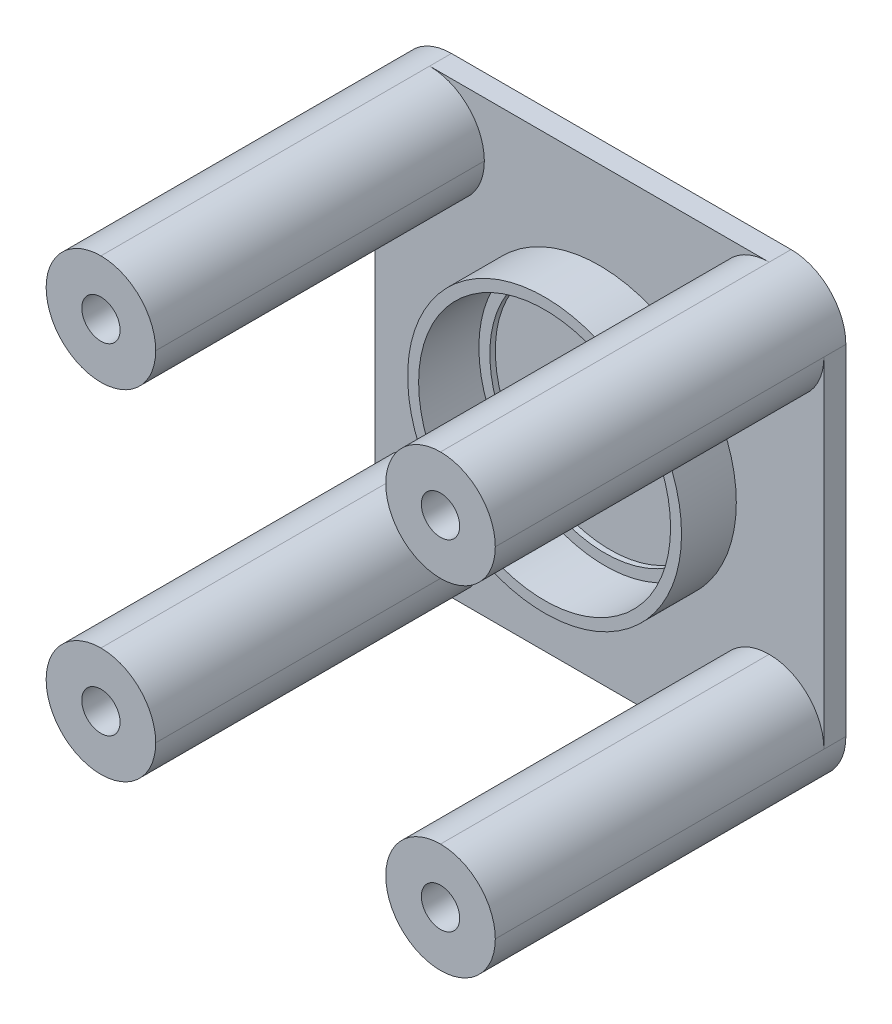
ISO-10303-21;
HEADER;
FILE_DESCRIPTION(('STEP AP214'),'2;1');
FILE_NAME('part.step','',(''),(''),'','','');
FILE_SCHEMA(('AUTOMOTIVE_DESIGN { 1 0 10303 214 1 1 1 1 }'));
ENDSEC;
DATA;
#1=APPLICATION_CONTEXT('core data for automotive mechanical design processes');
#2=APPLICATION_PROTOCOL_DEFINITION('international standard','automotive_design',2000,#1);
#3=PRODUCT_CONTEXT('',#1,'mechanical');
#4=PRODUCT('Part','Part','',(#3));
#5=PRODUCT_RELATED_PRODUCT_CATEGORY('part','',(#4));
#6=PRODUCT_DEFINITION_FORMATION('','',#4);
#7=PRODUCT_DEFINITION_CONTEXT('part definition',#1,'design');
#8=PRODUCT_DEFINITION('design','',#6,#7);
#9=PRODUCT_DEFINITION_SHAPE('','',#8);
#10=(LENGTH_UNIT() NAMED_UNIT(*) SI_UNIT(.MILLI.,.METRE.));
#11=(NAMED_UNIT(*) PLANE_ANGLE_UNIT() SI_UNIT($,.RADIAN.));
#12=(NAMED_UNIT(*) SI_UNIT($,.STERADIAN.) SOLID_ANGLE_UNIT());
#13=UNCERTAINTY_MEASURE_WITH_UNIT(LENGTH_MEASURE(1.E-05),#10,'distance_accuracy_value','');
#14=(GEOMETRIC_REPRESENTATION_CONTEXT(3) GLOBAL_UNCERTAINTY_ASSIGNED_CONTEXT((#13)) GLOBAL_UNIT_ASSIGNED_CONTEXT((#10,
#11,#12)) REPRESENTATION_CONTEXT('',''));
#15=CARTESIAN_POINT('',(0.,0.,0.));
#16=DIRECTION('',(0.,0.,1.));
#17=DIRECTION('',(1.,0.,0.));
#18=AXIS2_PLACEMENT_3D('',#15,#16,#17);
#19=CARTESIAN_POINT('',(-34.5083333333333,4.35624999999999,1.));
#20=DIRECTION('',(0.,0.,1.));
#21=DIRECTION('',(1.,0.,0.));
#22=AXIS2_PLACEMENT_3D('',#19,#20,#21);
#23=CYLINDRICAL_SURFACE('',#22,10.5);
#24=CARTESIAN_POINT('',(-34.5083333333333,4.35624999999999,1.));
#25=DIRECTION('',(0.,0.,1.));
#26=DIRECTION('',(1.,0.,0.));
#27=AXIS2_PLACEMENT_3D('',#24,#25,#26);
#28=CIRCLE('',#27,10.5);
#29=CARTESIAN_POINT('',(-24.0083333333333,4.35624999999999,1.));
#30=VERTEX_POINT('',#29);
#31=EDGE_CURVE('E317',#30,#30,#28,.T.);
#32=ORIENTED_EDGE('',*,*,#31,.F.);
#33=EDGE_LOOP('',(#32));
#34=FACE_BOUND('',#33,.T.);
#35=CARTESIAN_POINT('',(-34.5083333333333,4.35624999999999,1.5));
#36=DIRECTION('',(0.,0.,1.));
#37=DIRECTION('',(1.,0.,0.));
#38=AXIS2_PLACEMENT_3D('',#35,#36,#37);
#39=CIRCLE('',#38,10.5);
#40=CARTESIAN_POINT('',(-24.0083333333333,4.35624999999999,1.5));
#41=VERTEX_POINT('',#40);
#42=EDGE_CURVE('E45',#41,#41,#39,.F.);
#43=ORIENTED_EDGE('',*,*,#42,.F.);
#44=EDGE_LOOP('',(#43));
#45=FACE_BOUND('',#44,.T.);
#46=ADVANCED_FACE('F41',(#34,#45),#23,.F.);
#47=CARTESIAN_POINT('',(-34.5083333333333,4.35624999999999,2.));
#48=DIRECTION('',(0.,0.,-1.));
#49=DIRECTION('',(-1.,0.,0.));
#50=AXIS2_PLACEMENT_3D('',#47,#48,#49);
#51=CYLINDRICAL_SURFACE('',#50,1.25);
#52=CARTESIAN_POINT('',(-34.5083333333333,4.35624999999999,0.));
#53=DIRECTION('',(0.,0.,1.));
#54=DIRECTION('',(1.,0.,0.));
#55=AXIS2_PLACEMENT_3D('',#52,#53,#54);
#56=CIRCLE('',#55,1.25);
#57=CARTESIAN_POINT('',(-33.2583333333333,4.35624999999999,0.));
#58=VERTEX_POINT('',#57);
#59=EDGE_CURVE('E346',#58,#58,#56,.T.);
#60=ORIENTED_EDGE('',*,*,#59,.F.);
#61=EDGE_LOOP('',(#60));
#62=FACE_BOUND('',#61,.T.);
#63=CARTESIAN_POINT('',(-34.5083333333333,4.35624999999999,1.));
#64=DIRECTION('',(0.,0.,1.));
#65=DIRECTION('',(1.,0.,0.));
#66=AXIS2_PLACEMENT_3D('',#63,#64,#65);
#67=CIRCLE('',#66,1.25);
#68=CARTESIAN_POINT('',(-33.2583333333333,4.35624999999999,1.));
#69=VERTEX_POINT('',#68);
#70=EDGE_CURVE('E305',#69,#69,#67,.T.);
#71=ORIENTED_EDGE('',*,*,#70,.T.);
#72=EDGE_LOOP('',(#71));
#73=FACE_BOUND('',#72,.T.);
#74=ADVANCED_FACE('F521',(#62,#73),#51,.F.);
#75=CARTESIAN_POINT('',(0.,0.,2.));
#76=DIRECTION('',(0.,0.,1.));
#77=DIRECTION('',(1.,0.,0.));
#78=AXIS2_PLACEMENT_3D('',#75,#76,#77);
#79=PLANE('',#78);
#80=CARTESIAN_POINT('',(-34.5083333333333,4.35624999999999,2.));
#81=DIRECTION('',(0.,0.,1.));
#82=DIRECTION('',(1.,0.,0.));
#83=AXIS2_PLACEMENT_3D('',#80,#81,#82);
#84=CIRCLE('',#83,12.5);
#85=CARTESIAN_POINT('',(-22.0083333333333,4.35624999999999,2.));
#86=VERTEX_POINT('',#85);
#87=EDGE_CURVE('E832',#86,#86,#84,.T.);
#88=ORIENTED_EDGE('',*,*,#87,.F.);
#89=EDGE_LOOP('',(#88));
#90=FACE_BOUND('',#89,.T.);
#91=CARTESIAN_POINT('',(-19.0083333333333,19.85625,2.));
#92=DIRECTION('',(0.,0.,1.));
#93=DIRECTION('',(1.,0.,0.));
#94=AXIS2_PLACEMENT_3D('',#91,#92,#93);
#95=CIRCLE('',#94,5.);
#96=CARTESIAN_POINT('',(-14.0083333333333,19.85625,2.));
#97=VERTEX_POINT('',#96);
#98=CARTESIAN_POINT('',(-19.0083333333333,14.85625,2.));
#99=VERTEX_POINT('',#98);
#100=EDGE_CURVE('E59',#97,#99,#95,.F.);
#101=ORIENTED_EDGE('',*,*,#100,.T.);
#102=CARTESIAN_POINT('',(-19.0083333333333,19.85625,2.));
#103=DIRECTION('',(0.,0.,1.));
#104=DIRECTION('',(1.,0.,0.));
#105=AXIS2_PLACEMENT_3D('',#102,#103,#104);
#106=CIRCLE('',#105,5.);
#107=CARTESIAN_POINT('',(-24.0083333333333,19.85625,2.));
#108=VERTEX_POINT('',#107);
#109=EDGE_CURVE('E51',#99,#108,#106,.F.);
#110=ORIENTED_EDGE('',*,*,#109,.T.);
#111=CARTESIAN_POINT('',(-19.0083333333333,19.85625,2.));
#112=DIRECTION('',(0.,0.,1.));
#113=DIRECTION('',(1.,0.,0.));
#114=AXIS2_PLACEMENT_3D('',#111,#112,#113);
#115=CIRCLE('',#114,5.);
#116=CARTESIAN_POINT('',(-19.0083333333333,24.85625,2.));
#117=VERTEX_POINT('',#116);
#118=EDGE_CURVE('E221',#108,#117,#115,.F.);
#119=ORIENTED_EDGE('',*,*,#118,.T.);
#120=DIRECTION('',(-1.,0.,0.));
#121=VECTOR('',#120,1.);
#122=CARTESIAN_POINT('',(-55.0083333333333,24.85625,2.));
#123=LINE('',#122,#121);
#124=CARTESIAN_POINT('',(-50.0083333333333,24.85625,2.));
#125=VERTEX_POINT('',#124);
#126=EDGE_CURVE('E187',#117,#125,#123,.T.);
#127=ORIENTED_EDGE('',*,*,#126,.T.);
#128=CARTESIAN_POINT('',(-50.0083333333333,19.85625,2.));
#129=DIRECTION('',(0.,0.,1.));
#130=DIRECTION('',(1.,0.,0.));
#131=AXIS2_PLACEMENT_3D('',#128,#129,#130);
#132=CIRCLE('',#131,5.);
#133=CARTESIAN_POINT('',(-45.0083333333333,19.85625,2.));
#134=VERTEX_POINT('',#133);
#135=EDGE_CURVE('E239',#125,#134,#132,.F.);
#136=ORIENTED_EDGE('',*,*,#135,.T.);
#137=CARTESIAN_POINT('',(-50.0083333333333,19.85625,2.));
#138=DIRECTION('',(0.,0.,1.));
#139=DIRECTION('',(1.,0.,0.));
#140=AXIS2_PLACEMENT_3D('',#137,#138,#139);
#141=CIRCLE('',#140,5.);
#142=CARTESIAN_POINT('',(-50.0083333333333,14.85625,2.));
#143=VERTEX_POINT('',#142);
#144=EDGE_CURVE('E11',#134,#143,#141,.F.);
#145=ORIENTED_EDGE('',*,*,#144,.T.);
#146=CARTESIAN_POINT('',(-50.0083333333333,19.85625,2.));
#147=DIRECTION('',(0.,0.,1.));
#148=DIRECTION('',(1.,0.,0.));
#149=AXIS2_PLACEMENT_3D('',#146,#147,#148);
#150=CIRCLE('',#149,5.);
#151=CARTESIAN_POINT('',(-55.0083333333333,19.85625,2.));
#152=VERTEX_POINT('',#151);
#153=EDGE_CURVE('E235',#143,#152,#150,.F.);
#154=ORIENTED_EDGE('',*,*,#153,.T.);
#155=DIRECTION('',(0.,-1.,0.));
#156=VECTOR('',#155,1.);
#157=CARTESIAN_POINT('',(-55.0083333333333,24.85625,2.));
#158=LINE('',#157,#156);
#159=CARTESIAN_POINT('',(-55.0083333333333,-11.14375,2.));
#160=VERTEX_POINT('',#159);
#161=EDGE_CURVE('E207',#152,#160,#158,.T.);
#162=ORIENTED_EDGE('',*,*,#161,.T.);
#163=CARTESIAN_POINT('',(-50.0083333333333,-11.14375,2.));
#164=DIRECTION('',(0.,0.,1.));
#165=DIRECTION('',(1.,0.,0.));
#166=AXIS2_PLACEMENT_3D('',#163,#164,#165);
#167=CIRCLE('',#166,5.);
#168=CARTESIAN_POINT('',(-50.0083333333333,-6.14375000000001,2.));
#169=VERTEX_POINT('',#168);
#170=EDGE_CURVE('E232',#160,#169,#167,.F.);
#171=ORIENTED_EDGE('',*,*,#170,.T.);
#172=CARTESIAN_POINT('',(-50.0083333333333,-11.14375,2.));
#173=DIRECTION('',(0.,0.,1.));
#174=DIRECTION('',(1.,0.,0.));
#175=AXIS2_PLACEMENT_3D('',#172,#173,#174);
#176=CIRCLE('',#175,5.);
#177=CARTESIAN_POINT('',(-45.0083333333333,-11.14375,2.));
#178=VERTEX_POINT('',#177);
#179=EDGE_CURVE('E66',#169,#178,#176,.F.);
#180=ORIENTED_EDGE('',*,*,#179,.T.);
#181=CARTESIAN_POINT('',(-50.0083333333333,-11.14375,2.));
#182=DIRECTION('',(0.,0.,1.));
#183=DIRECTION('',(1.,0.,0.));
#184=AXIS2_PLACEMENT_3D('',#181,#182,#183);
#185=CIRCLE('',#184,5.);
#186=CARTESIAN_POINT('',(-50.0083333333333,-16.14375,2.));
#187=VERTEX_POINT('',#186);
#188=EDGE_CURVE('E244',#178,#187,#185,.F.);
#189=ORIENTED_EDGE('',*,*,#188,.T.);
#190=DIRECTION('',(1.,0.,0.));
#191=VECTOR('',#190,1.);
#192=CARTESIAN_POINT('',(-55.0083333333333,-16.14375,2.));
#193=LINE('',#192,#191);
#194=CARTESIAN_POINT('',(-19.0083333333333,-16.14375,2.));
#195=VERTEX_POINT('',#194);
#196=EDGE_CURVE('E369',#187,#195,#193,.T.);
#197=ORIENTED_EDGE('',*,*,#196,.T.);
#198=CARTESIAN_POINT('',(-19.0083333333333,-11.14375,2.));
#199=DIRECTION('',(0.,0.,1.));
#200=DIRECTION('',(1.,0.,0.));
#201=AXIS2_PLACEMENT_3D('',#198,#199,#200);
#202=CIRCLE('',#201,5.);
#203=CARTESIAN_POINT('',(-24.0083333333333,-11.14375,2.));
#204=VERTEX_POINT('',#203);
#205=EDGE_CURVE('E247',#195,#204,#202,.F.);
#206=ORIENTED_EDGE('',*,*,#205,.T.);
#207=CARTESIAN_POINT('',(-19.0083333333333,-11.14375,2.));
#208=DIRECTION('',(0.,0.,1.));
#209=DIRECTION('',(1.,0.,0.));
#210=AXIS2_PLACEMENT_3D('',#207,#208,#209);
#211=CIRCLE('',#210,5.);
#212=CARTESIAN_POINT('',(-19.0083333333333,-6.14375000000001,2.));
#213=VERTEX_POINT('',#212);
#214=EDGE_CURVE('E228',#204,#213,#211,.F.);
#215=ORIENTED_EDGE('',*,*,#214,.T.);
#216=CARTESIAN_POINT('',(-19.0083333333333,-11.14375,2.));
#217=DIRECTION('',(0.,0.,1.));
#218=DIRECTION('',(1.,0.,0.));
#219=AXIS2_PLACEMENT_3D('',#216,#217,#218);
#220=CIRCLE('',#219,5.);
#221=CARTESIAN_POINT('',(-14.0083333333333,-11.14375,2.));
#222=VERTEX_POINT('',#221);
#223=EDGE_CURVE('E250',#213,#222,#220,.F.);
#224=ORIENTED_EDGE('',*,*,#223,.T.);
#225=DIRECTION('',(0.,1.,0.));
#226=VECTOR('',#225,1.);
#227=CARTESIAN_POINT('',(-14.0083333333333,24.85625,2.));
#228=LINE('',#227,#226);
#229=EDGE_CURVE('E372',#222,#97,#228,.T.);
#230=ORIENTED_EDGE('',*,*,#229,.T.);
#231=EDGE_LOOP('',(#101,#110,#119,#127,#136,#145,#154,#162,#171,#180,#189,#197,#206,#215,#224,#230));
#232=FACE_BOUND('',#231,.T.);
#233=ADVANCED_FACE('F493',(#90,#232),#79,.T.);
#234=CARTESIAN_POINT('',(0.,0.,0.));
#235=DIRECTION('',(0.,0.,1.));
#236=DIRECTION('',(1.,0.,0.));
#237=AXIS2_PLACEMENT_3D('',#234,#235,#236);
#238=PLANE('',#237);
#239=DIRECTION('',(0.,1.,0.));
#240=VECTOR('',#239,1.);
#241=CARTESIAN_POINT('',(-14.0083333333333,24.85625,0.));
#242=LINE('',#241,#240);
#243=CARTESIAN_POINT('',(-14.0083333333333,-11.14375,0.));
#244=VERTEX_POINT('',#243);
#245=CARTESIAN_POINT('',(-14.0083333333333,19.85625,0.));
#246=VERTEX_POINT('',#245);
#247=EDGE_CURVE('E208',#244,#246,#242,.T.);
#248=ORIENTED_EDGE('',*,*,#247,.F.);
#249=CARTESIAN_POINT('',(-19.0083333333333,-11.14375,0.));
#250=DIRECTION('',(0.,0.,1.));
#251=DIRECTION('',(1.,0.,0.));
#252=AXIS2_PLACEMENT_3D('',#249,#250,#251);
#253=CIRCLE('',#252,5.);
#254=CARTESIAN_POINT('',(-19.0083333333333,-16.14375,0.));
#255=VERTEX_POINT('',#254);
#256=EDGE_CURVE('E216',#244,#255,#253,.F.);
#257=ORIENTED_EDGE('',*,*,#256,.T.);
#258=DIRECTION('',(1.,0.,0.));
#259=VECTOR('',#258,1.);
#260=CARTESIAN_POINT('',(-55.0083333333333,-16.14375,0.));
#261=LINE('',#260,#259);
#262=CARTESIAN_POINT('',(-50.0083333333333,-16.14375,0.));
#263=VERTEX_POINT('',#262);
#264=EDGE_CURVE('E380',#263,#255,#261,.T.);
#265=ORIENTED_EDGE('',*,*,#264,.F.);
#266=CARTESIAN_POINT('',(-50.0083333333333,-11.14375,0.));
#267=DIRECTION('',(0.,0.,1.));
#268=DIRECTION('',(1.,0.,0.));
#269=AXIS2_PLACEMENT_3D('',#266,#267,#268);
#270=CIRCLE('',#269,5.);
#271=CARTESIAN_POINT('',(-55.0083333333333,-11.14375,0.));
#272=VERTEX_POINT('',#271);
#273=EDGE_CURVE('E217',#263,#272,#270,.F.);
#274=ORIENTED_EDGE('',*,*,#273,.T.);
#275=DIRECTION('',(0.,-1.,0.));
#276=VECTOR('',#275,1.);
#277=CARTESIAN_POINT('',(-55.0083333333333,24.85625,0.));
#278=LINE('',#277,#276);
#279=CARTESIAN_POINT('',(-55.0083333333333,19.85625,0.));
#280=VERTEX_POINT('',#279);
#281=EDGE_CURVE('E366',#280,#272,#278,.T.);
#282=ORIENTED_EDGE('',*,*,#281,.F.);
#283=CARTESIAN_POINT('',(-50.0083333333333,19.85625,0.));
#284=DIRECTION('',(0.,0.,1.));
#285=DIRECTION('',(1.,0.,0.));
#286=AXIS2_PLACEMENT_3D('',#283,#284,#285);
#287=CIRCLE('',#286,5.);
#288=CARTESIAN_POINT('',(-50.0083333333333,24.85625,0.));
#289=VERTEX_POINT('',#288);
#290=EDGE_CURVE('E205',#280,#289,#287,.F.);
#291=ORIENTED_EDGE('',*,*,#290,.T.);
#292=DIRECTION('',(-1.,0.,0.));
#293=VECTOR('',#292,1.);
#294=CARTESIAN_POINT('',(-55.0083333333333,24.85625,0.));
#295=LINE('',#294,#293);
#296=CARTESIAN_POINT('',(-19.0083333333333,24.85625,0.));
#297=VERTEX_POINT('',#296);
#298=EDGE_CURVE('E185',#297,#289,#295,.T.);
#299=ORIENTED_EDGE('',*,*,#298,.F.);
#300=CARTESIAN_POINT('',(-19.0083333333333,19.85625,0.));
#301=DIRECTION('',(0.,0.,1.));
#302=DIRECTION('',(1.,0.,0.));
#303=AXIS2_PLACEMENT_3D('',#300,#301,#302);
#304=CIRCLE('',#303,5.);
#305=EDGE_CURVE('E201',#297,#246,#304,.F.);
#306=ORIENTED_EDGE('',*,*,#305,.T.);
#307=EDGE_LOOP('',(#248,#257,#265,#274,#282,#291,#299,#306));
#308=FACE_BOUND('',#307,.T.);
#309=CARTESIAN_POINT('',(-50.0083333333333,19.85625,0.));
#310=DIRECTION('',(0.,0.,1.));
#311=DIRECTION('',(1.,0.,0.));
#312=AXIS2_PLACEMENT_3D('',#309,#310,#311);
#313=CIRCLE('',#312,1.75);
#314=CARTESIAN_POINT('',(-48.2583333333333,19.85625,0.));
#315=VERTEX_POINT('',#314);
#316=EDGE_CURVE('E362',#315,#315,#313,.T.);
#317=ORIENTED_EDGE('',*,*,#316,.T.);
#318=EDGE_LOOP('',(#317));
#319=FACE_BOUND('',#318,.T.);
#320=CARTESIAN_POINT('',(-50.0083333333333,-11.14375,0.));
#321=DIRECTION('',(0.,0.,1.));
#322=DIRECTION('',(1.,0.,0.));
#323=AXIS2_PLACEMENT_3D('',#320,#321,#322);
#324=CIRCLE('',#323,1.75);
#325=CARTESIAN_POINT('',(-48.2583333333333,-11.14375,0.));
#326=VERTEX_POINT('',#325);
#327=EDGE_CURVE('E358',#326,#326,#324,.T.);
#328=ORIENTED_EDGE('',*,*,#327,.T.);
#329=EDGE_LOOP('',(#328));
#330=FACE_BOUND('',#329,.T.);
#331=CARTESIAN_POINT('',(-19.0083333333333,-11.14375,0.));
#332=DIRECTION('',(0.,0.,1.));
#333=DIRECTION('',(1.,0.,0.));
#334=AXIS2_PLACEMENT_3D('',#331,#332,#333);
#335=CIRCLE('',#334,1.75);
#336=CARTESIAN_POINT('',(-17.2583333333333,-11.14375,0.));
#337=VERTEX_POINT('',#336);
#338=EDGE_CURVE('E354',#337,#337,#335,.T.);
#339=ORIENTED_EDGE('',*,*,#338,.T.);
#340=EDGE_LOOP('',(#339));
#341=FACE_BOUND('',#340,.T.);
#342=CARTESIAN_POINT('',(-19.0083333333333,19.85625,0.));
#343=DIRECTION('',(0.,0.,1.));
#344=DIRECTION('',(1.,0.,0.));
#345=AXIS2_PLACEMENT_3D('',#342,#343,#344);
#346=CIRCLE('',#345,1.75);
#347=CARTESIAN_POINT('',(-17.2583333333333,19.85625,0.));
#348=VERTEX_POINT('',#347);
#349=EDGE_CURVE('E350',#348,#348,#346,.T.);
#350=ORIENTED_EDGE('',*,*,#349,.T.);
#351=EDGE_LOOP('',(#350));
#352=FACE_BOUND('',#351,.T.);
#353=ORIENTED_EDGE('',*,*,#59,.T.);
#354=EDGE_LOOP('',(#353));
#355=FACE_BOUND('',#354,.T.);
#356=ADVANCED_FACE('F199',(#308,#319,#330,#341,#352,#355),#238,.F.);
#357=CARTESIAN_POINT('',(-55.0083333333333,24.85625,2.));
#358=DIRECTION('',(1.,0.,0.));
#359=DIRECTION('',(0.,1.,0.));
#360=AXIS2_PLACEMENT_3D('',#357,#358,#359);
#361=PLANE('',#360);
#362=DIRECTION('',(0.,0.,-1.));
#363=VECTOR('',#362,1.);
#364=CARTESIAN_POINT('',(-55.0083333333333,-11.14375,2.));
#365=LINE('',#364,#363);
#366=EDGE_CURVE('E416',#272,#160,#365,.F.);
#367=ORIENTED_EDGE('',*,*,#366,.T.);
#368=ORIENTED_EDGE('',*,*,#161,.F.);
#369=DIRECTION('',(0.,0.,-1.));
#370=VECTOR('',#369,1.);
#371=CARTESIAN_POINT('',(-55.0083333333333,19.85625,2.));
#372=LINE('',#371,#370);
#373=EDGE_CURVE('E413',#152,#280,#372,.T.);
#374=ORIENTED_EDGE('',*,*,#373,.T.);
#375=ORIENTED_EDGE('',*,*,#281,.T.);
#376=EDGE_LOOP('',(#367,#368,#374,#375));
#377=FACE_BOUND('',#376,.T.);
#378=ADVANCED_FACE('F481',(#377),#361,.F.);
#379=CARTESIAN_POINT('',(-55.0083333333333,-16.14375,2.));
#380=DIRECTION('',(0.,1.,0.));
#381=DIRECTION('',(0.,0.,1.));
#382=AXIS2_PLACEMENT_3D('',#379,#380,#381);
#383=PLANE('',#382);
#384=DIRECTION('',(0.,0.,-1.));
#385=VECTOR('',#384,1.);
#386=CARTESIAN_POINT('',(-19.0083333333333,-16.14375,2.));
#387=LINE('',#386,#385);
#388=EDGE_CURVE('E449',#255,#195,#387,.F.);
#389=ORIENTED_EDGE('',*,*,#388,.T.);
#390=ORIENTED_EDGE('',*,*,#196,.F.);
#391=DIRECTION('',(0.,0.,-1.));
#392=VECTOR('',#391,1.);
#393=CARTESIAN_POINT('',(-50.0083333333333,-16.14375,2.));
#394=LINE('',#393,#392);
#395=EDGE_CURVE('E446',#187,#263,#394,.T.);
#396=ORIENTED_EDGE('',*,*,#395,.T.);
#397=ORIENTED_EDGE('',*,*,#264,.T.);
#398=EDGE_LOOP('',(#389,#390,#396,#397));
#399=FACE_BOUND('',#398,.T.);
#400=ADVANCED_FACE('F471',(#399),#383,.F.);
#401=CARTESIAN_POINT('',(-14.0083333333333,24.85625,2.));
#402=DIRECTION('',(-1.,0.,0.));
#403=DIRECTION('',(0.,-1.,0.));
#404=AXIS2_PLACEMENT_3D('',#401,#402,#403);
#405=PLANE('',#404);
#406=ORIENTED_EDGE('',*,*,#229,.F.);
#407=DIRECTION('',(0.,0.,-1.));
#408=VECTOR('',#407,1.);
#409=CARTESIAN_POINT('',(-14.0083333333333,-11.14375,2.));
#410=LINE('',#409,#408);
#411=EDGE_CURVE('E455',#222,#244,#410,.T.);
#412=ORIENTED_EDGE('',*,*,#411,.T.);
#413=ORIENTED_EDGE('',*,*,#247,.T.);
#414=DIRECTION('',(0.,0.,-1.));
#415=VECTOR('',#414,1.);
#416=CARTESIAN_POINT('',(-14.0083333333333,19.85625,2.));
#417=LINE('',#416,#415);
#418=EDGE_CURVE('E214',#246,#97,#417,.F.);
#419=ORIENTED_EDGE('',*,*,#418,.T.);
#420=EDGE_LOOP('',(#406,#412,#413,#419));
#421=FACE_BOUND('',#420,.T.);
#422=ADVANCED_FACE('F460',(#421),#405,.F.);
#423=CARTESIAN_POINT('',(-55.0083333333333,24.85625,2.));
#424=DIRECTION('',(0.,-1.,0.));
#425=DIRECTION('',(0.,0.,-1.));
#426=AXIS2_PLACEMENT_3D('',#423,#424,#425);
#427=PLANE('',#426);
#428=ORIENTED_EDGE('',*,*,#126,.F.);
#429=DIRECTION('',(0.,0.,-1.));
#430=VECTOR('',#429,1.);
#431=CARTESIAN_POINT('',(-19.0083333333333,24.85625,2.));
#432=LINE('',#431,#430);
#433=EDGE_CURVE('E181',#117,#297,#432,.T.);
#434=ORIENTED_EDGE('',*,*,#433,.T.);
#435=ORIENTED_EDGE('',*,*,#298,.T.);
#436=DIRECTION('',(0.,0.,-1.));
#437=VECTOR('',#436,1.);
#438=CARTESIAN_POINT('',(-50.0083333333333,24.85625,2.));
#439=LINE('',#438,#437);
#440=EDGE_CURVE('E195',#289,#125,#439,.F.);
#441=ORIENTED_EDGE('',*,*,#440,.T.);
#442=EDGE_LOOP('',(#428,#434,#435,#441));
#443=FACE_BOUND('',#442,.T.);
#444=ADVANCED_FACE('F183',(#443),#427,.F.);
#445=CARTESIAN_POINT('',(-50.0083333333333,19.85625,2.));
#446=DIRECTION('',(0.,0.,-1.));
#447=DIRECTION('',(-1.,0.,0.));
#448=AXIS2_PLACEMENT_3D('',#445,#446,#447);
#449=CYLINDRICAL_SURFACE('',#448,1.75);
#450=ORIENTED_EDGE('',*,*,#316,.F.);
#451=EDGE_LOOP('',(#450));
#452=FACE_BOUND('',#451,.T.);
#453=CARTESIAN_POINT('',(-50.0083333333333,19.85625,32.));
#454=DIRECTION('',(0.,0.,1.));
#455=DIRECTION('',(1.,0.,0.));
#456=AXIS2_PLACEMENT_3D('',#453,#454,#455);
#457=CIRCLE('',#456,1.75);
#458=CARTESIAN_POINT('',(-48.2583333333333,19.85625,32.));
#459=VERTEX_POINT('',#458);
#460=EDGE_CURVE('E342',#459,#459,#457,.T.);
#461=ORIENTED_EDGE('',*,*,#460,.T.);
#462=EDGE_LOOP('',(#461));
#463=FACE_BOUND('',#462,.T.);
#464=ADVANCED_FACE('F561',(#452,#463),#449,.F.);
#465=CARTESIAN_POINT('',(-50.0083333333333,-11.14375,2.));
#466=DIRECTION('',(0.,0.,-1.));
#467=DIRECTION('',(-1.,0.,0.));
#468=AXIS2_PLACEMENT_3D('',#465,#466,#467);
#469=CYLINDRICAL_SURFACE('',#468,1.75);
#470=ORIENTED_EDGE('',*,*,#327,.F.);
#471=EDGE_LOOP('',(#470));
#472=FACE_BOUND('',#471,.T.);
#473=CARTESIAN_POINT('',(-50.0083333333333,-11.14375,32.));
#474=DIRECTION('',(0.,0.,1.));
#475=DIRECTION('',(1.,0.,0.));
#476=AXIS2_PLACEMENT_3D('',#473,#474,#475);
#477=CIRCLE('',#476,1.75);
#478=CARTESIAN_POINT('',(-48.2583333333333,-11.14375,32.));
#479=VERTEX_POINT('',#478);
#480=EDGE_CURVE('E338',#479,#479,#477,.T.);
#481=ORIENTED_EDGE('',*,*,#480,.T.);
#482=EDGE_LOOP('',(#481));
#483=FACE_BOUND('',#482,.T.);
#484=ADVANCED_FACE('F557',(#472,#483),#469,.F.);
#485=CARTESIAN_POINT('',(-19.0083333333333,-11.14375,2.));
#486=DIRECTION('',(0.,0.,-1.));
#487=DIRECTION('',(-1.,0.,0.));
#488=AXIS2_PLACEMENT_3D('',#485,#486,#487);
#489=CYLINDRICAL_SURFACE('',#488,1.75);
#490=ORIENTED_EDGE('',*,*,#338,.F.);
#491=EDGE_LOOP('',(#490));
#492=FACE_BOUND('',#491,.T.);
#493=CARTESIAN_POINT('',(-19.0083333333333,-11.14375,32.));
#494=DIRECTION('',(0.,0.,1.));
#495=DIRECTION('',(1.,0.,0.));
#496=AXIS2_PLACEMENT_3D('',#493,#494,#495);
#497=CIRCLE('',#496,1.75);
#498=CARTESIAN_POINT('',(-17.2583333333333,-11.14375,32.));
#499=VERTEX_POINT('',#498);
#500=EDGE_CURVE('E334',#499,#499,#497,.T.);
#501=ORIENTED_EDGE('',*,*,#500,.T.);
#502=EDGE_LOOP('',(#501));
#503=FACE_BOUND('',#502,.T.);
#504=ADVANCED_FACE('F553',(#492,#503),#489,.F.);
#505=CARTESIAN_POINT('',(-19.0083333333333,19.85625,2.));
#506=DIRECTION('',(0.,0.,-1.));
#507=DIRECTION('',(-1.,0.,0.));
#508=AXIS2_PLACEMENT_3D('',#505,#506,#507);
#509=CYLINDRICAL_SURFACE('',#508,1.75);
#510=ORIENTED_EDGE('',*,*,#349,.F.);
#511=EDGE_LOOP('',(#510));
#512=FACE_BOUND('',#511,.T.);
#513=CARTESIAN_POINT('',(-19.0083333333333,19.85625,32.));
#514=DIRECTION('',(0.,0.,1.));
#515=DIRECTION('',(1.,0.,0.));
#516=AXIS2_PLACEMENT_3D('',#513,#514,#515);
#517=CIRCLE('',#516,1.75);
#518=CARTESIAN_POINT('',(-17.2583333333333,19.85625,32.));
#519=VERTEX_POINT('',#518);
#520=EDGE_CURVE('E272',#519,#519,#517,.T.);
#521=ORIENTED_EDGE('',*,*,#520,.T.);
#522=EDGE_LOOP('',(#521));
#523=FACE_BOUND('',#522,.T.);
#524=ADVANCED_FACE('F548',(#512,#523),#509,.F.);
#525=CARTESIAN_POINT('',(0.,0.,32.));
#526=DIRECTION('',(0.,0.,1.));
#527=DIRECTION('',(1.,0.,0.));
#528=AXIS2_PLACEMENT_3D('',#525,#526,#527);
#529=PLANE('',#528);
#530=CARTESIAN_POINT('',(-50.0083333333333,19.85625,32.));
#531=DIRECTION('',(0.,0.,1.));
#532=DIRECTION('',(1.,0.,0.));
#533=AXIS2_PLACEMENT_3D('',#530,#531,#532);
#534=CIRCLE('',#533,5.);
#535=CARTESIAN_POINT('',(-55.0083333333333,19.85625,32.));
#536=VERTEX_POINT('',#535);
#537=CARTESIAN_POINT('',(-50.0083333333333,14.85625,32.));
#538=VERTEX_POINT('',#537);
#539=EDGE_CURVE('E439',#536,#538,#534,.T.);
#540=ORIENTED_EDGE('',*,*,#539,.T.);
#541=CARTESIAN_POINT('',(-50.0083333333333,19.85625,32.));
#542=DIRECTION('',(0.,0.,1.));
#543=DIRECTION('',(1.,0.,0.));
#544=AXIS2_PLACEMENT_3D('',#541,#542,#543);
#545=CIRCLE('',#544,5.);
#546=CARTESIAN_POINT('',(-45.0083333333333,19.85625,32.));
#547=VERTEX_POINT('',#546);
#548=EDGE_CURVE('E443',#538,#547,#545,.T.);
#549=ORIENTED_EDGE('',*,*,#548,.T.);
#550=CARTESIAN_POINT('',(-50.0083333333333,19.85625,32.));
#551=DIRECTION('',(0.,0.,1.));
#552=DIRECTION('',(1.,0.,0.));
#553=AXIS2_PLACEMENT_3D('',#550,#551,#552);
#554=CIRCLE('',#553,5.);
#555=CARTESIAN_POINT('',(-50.0083333333333,24.85625,32.));
#556=VERTEX_POINT('',#555);
#557=EDGE_CURVE('E436',#547,#556,#554,.T.);
#558=ORIENTED_EDGE('',*,*,#557,.T.);
#559=CARTESIAN_POINT('',(-50.0083333333333,19.85625,32.));
#560=DIRECTION('',(0.,0.,1.));
#561=DIRECTION('',(1.,0.,0.));
#562=AXIS2_PLACEMENT_3D('',#559,#560,#561);
#563=CIRCLE('',#562,5.);
#564=EDGE_CURVE('E433',#556,#536,#563,.T.);
#565=ORIENTED_EDGE('',*,*,#564,.T.);
#566=EDGE_LOOP('',(#540,#549,#558,#565));
#567=FACE_BOUND('',#566,.T.);
#568=ORIENTED_EDGE('',*,*,#460,.F.);
#569=EDGE_LOOP('',(#568));
#570=FACE_BOUND('',#569,.T.);
#571=ADVANCED_FACE('F545',(#567,#570),#529,.T.);
#572=CARTESIAN_POINT('',(0.,0.,32.));
#573=DIRECTION('',(0.,0.,-1.));
#574=DIRECTION('',(-1.,0.,0.));
#575=AXIS2_PLACEMENT_3D('',#572,#573,#574);
#576=PLANE('',#575);
#577=CARTESIAN_POINT('',(-50.0083333333333,-11.14375,32.));
#578=DIRECTION('',(0.,0.,-1.));
#579=DIRECTION('',(-1.,0.,0.));
#580=AXIS2_PLACEMENT_3D('',#577,#578,#579);
#581=CIRCLE('',#580,5.);
#582=CARTESIAN_POINT('',(-45.0083333333333,-11.14375,32.));
#583=VERTEX_POINT('',#582);
#584=CARTESIAN_POINT('',(-50.0083333333333,-6.14375000000001,32.));
#585=VERTEX_POINT('',#584);
#586=EDGE_CURVE('E426',#583,#585,#581,.F.);
#587=ORIENTED_EDGE('',*,*,#586,.T.);
#588=CARTESIAN_POINT('',(-50.0083333333333,-11.14375,32.));
#589=DIRECTION('',(0.,0.,-1.));
#590=DIRECTION('',(-1.,0.,0.));
#591=AXIS2_PLACEMENT_3D('',#588,#589,#590);
#592=CIRCLE('',#591,5.);
#593=CARTESIAN_POINT('',(-55.0083333333333,-11.14375,32.));
#594=VERTEX_POINT('',#593);
#595=EDGE_CURVE('E429',#585,#594,#592,.F.);
#596=ORIENTED_EDGE('',*,*,#595,.T.);
#597=CARTESIAN_POINT('',(-50.0083333333333,-11.14375,32.));
#598=DIRECTION('',(0.,0.,-1.));
#599=DIRECTION('',(-1.,0.,0.));
#600=AXIS2_PLACEMENT_3D('',#597,#598,#599);
#601=CIRCLE('',#600,5.);
#602=CARTESIAN_POINT('',(-50.0083333333333,-16.14375,32.));
#603=VERTEX_POINT('',#602);
#604=EDGE_CURVE('E420',#594,#603,#601,.F.);
#605=ORIENTED_EDGE('',*,*,#604,.T.);
#606=CARTESIAN_POINT('',(-50.0083333333333,-11.14375,32.));
#607=DIRECTION('',(0.,0.,-1.));
#608=DIRECTION('',(-1.,0.,0.));
#609=AXIS2_PLACEMENT_3D('',#606,#607,#608);
#610=CIRCLE('',#609,5.);
#611=EDGE_CURVE('E423',#603,#583,#610,.F.);
#612=ORIENTED_EDGE('',*,*,#611,.T.);
#613=EDGE_LOOP('',(#587,#596,#605,#612));
#614=FACE_BOUND('',#613,.T.);
#615=ORIENTED_EDGE('',*,*,#480,.F.);
#616=EDGE_LOOP('',(#615));
#617=FACE_BOUND('',#616,.T.);
#618=ADVANCED_FACE('F541',(#614,#617),#576,.F.);
#619=CARTESIAN_POINT('',(0.,0.,32.));
#620=DIRECTION('',(0.,0.,1.));
#621=DIRECTION('',(1.,0.,0.));
#622=AXIS2_PLACEMENT_3D('',#619,#620,#621);
#623=PLANE('',#622);
#624=CARTESIAN_POINT('',(-19.0083333333333,-11.14375,32.));
#625=DIRECTION('',(0.,0.,1.));
#626=DIRECTION('',(1.,0.,0.));
#627=AXIS2_PLACEMENT_3D('',#624,#625,#626);
#628=CIRCLE('',#627,5.);
#629=CARTESIAN_POINT('',(-14.0083333333333,-11.14375,32.));
#630=VERTEX_POINT('',#629);
#631=CARTESIAN_POINT('',(-19.0083333333333,-6.14375000000001,32.));
#632=VERTEX_POINT('',#631);
#633=EDGE_CURVE('E403',#630,#632,#628,.T.);
#634=ORIENTED_EDGE('',*,*,#633,.T.);
#635=CARTESIAN_POINT('',(-19.0083333333333,-11.14375,32.));
#636=DIRECTION('',(0.,0.,1.));
#637=DIRECTION('',(1.,0.,0.));
#638=AXIS2_PLACEMENT_3D('',#635,#636,#637);
#639=CIRCLE('',#638,5.);
#640=CARTESIAN_POINT('',(-24.0083333333333,-11.14375,32.));
#641=VERTEX_POINT('',#640);
#642=EDGE_CURVE('E409',#632,#641,#639,.T.);
#643=ORIENTED_EDGE('',*,*,#642,.T.);
#644=CARTESIAN_POINT('',(-19.0083333333333,-11.14375,32.));
#645=DIRECTION('',(0.,0.,1.));
#646=DIRECTION('',(1.,0.,0.));
#647=AXIS2_PLACEMENT_3D('',#644,#645,#646);
#648=CIRCLE('',#647,5.);
#649=CARTESIAN_POINT('',(-19.0083333333333,-16.14375,32.));
#650=VERTEX_POINT('',#649);
#651=EDGE_CURVE('E406',#641,#650,#648,.T.);
#652=ORIENTED_EDGE('',*,*,#651,.T.);
#653=CARTESIAN_POINT('',(-19.0083333333333,-11.14375,32.));
#654=DIRECTION('',(0.,0.,1.));
#655=DIRECTION('',(1.,0.,0.));
#656=AXIS2_PLACEMENT_3D('',#653,#654,#655);
#657=CIRCLE('',#656,5.);
#658=EDGE_CURVE('E400',#650,#630,#657,.T.);
#659=ORIENTED_EDGE('',*,*,#658,.T.);
#660=EDGE_LOOP('',(#634,#643,#652,#659));
#661=FACE_BOUND('',#660,.T.);
#662=ORIENTED_EDGE('',*,*,#500,.F.);
#663=EDGE_LOOP('',(#662));
#664=FACE_BOUND('',#663,.T.);
#665=ADVANCED_FACE('F538',(#661,#664),#623,.T.);
#666=CARTESIAN_POINT('',(0.,0.,32.));
#667=DIRECTION('',(0.,0.,-1.));
#668=DIRECTION('',(-1.,0.,0.));
#669=AXIS2_PLACEMENT_3D('',#666,#667,#668);
#670=PLANE('',#669);
#671=CARTESIAN_POINT('',(-19.0083333333333,19.85625,32.));
#672=DIRECTION('',(0.,0.,-1.));
#673=DIRECTION('',(-1.,0.,0.));
#674=AXIS2_PLACEMENT_3D('',#671,#672,#673);
#675=CIRCLE('',#674,5.);
#676=CARTESIAN_POINT('',(-19.0083333333333,24.85625,32.));
#677=VERTEX_POINT('',#676);
#678=CARTESIAN_POINT('',(-24.0083333333333,19.85625,32.));
#679=VERTEX_POINT('',#678);
#680=EDGE_CURVE('E393',#677,#679,#675,.F.);
#681=ORIENTED_EDGE('',*,*,#680,.T.);
#682=CARTESIAN_POINT('',(-19.0083333333333,19.85625,32.));
#683=DIRECTION('',(0.,0.,-1.));
#684=DIRECTION('',(-1.,0.,0.));
#685=AXIS2_PLACEMENT_3D('',#682,#683,#684);
#686=CIRCLE('',#685,5.);
#687=CARTESIAN_POINT('',(-19.0083333333333,14.85625,32.));
#688=VERTEX_POINT('',#687);
#689=EDGE_CURVE('E397',#679,#688,#686,.F.);
#690=ORIENTED_EDGE('',*,*,#689,.T.);
#691=CARTESIAN_POINT('',(-19.0083333333333,19.85625,32.));
#692=DIRECTION('',(0.,0.,-1.));
#693=DIRECTION('',(-1.,0.,0.));
#694=AXIS2_PLACEMENT_3D('',#691,#692,#693);
#695=CIRCLE('',#694,5.);
#696=CARTESIAN_POINT('',(-14.0083333333333,19.85625,32.));
#697=VERTEX_POINT('',#696);
#698=EDGE_CURVE('E390',#688,#697,#695,.F.);
#699=ORIENTED_EDGE('',*,*,#698,.T.);
#700=CARTESIAN_POINT('',(-19.0083333333333,19.85625,32.));
#701=DIRECTION('',(0.,0.,-1.));
#702=DIRECTION('',(-1.,0.,0.));
#703=AXIS2_PLACEMENT_3D('',#700,#701,#702);
#704=CIRCLE('',#703,5.);
#705=EDGE_CURVE('E194',#697,#677,#704,.F.);
#706=ORIENTED_EDGE('',*,*,#705,.T.);
#707=EDGE_LOOP('',(#681,#690,#699,#706));
#708=FACE_BOUND('',#707,.T.);
#709=ORIENTED_EDGE('',*,*,#520,.F.);
#710=EDGE_LOOP('',(#709));
#711=FACE_BOUND('',#710,.T.);
#712=ADVANCED_FACE('F505',(#708,#711),#670,.F.);
#713=CARTESIAN_POINT('',(-19.0083333333333,19.85625,2.));
#714=DIRECTION('',(0.,0.,-1.));
#715=DIRECTION('',(-1.,0.,0.));
#716=AXIS2_PLACEMENT_3D('',#713,#714,#715);
#717=CYLINDRICAL_SURFACE('',#716,5.);
#718=DIRECTION('',(0.,0.,-1.));
#719=VECTOR('',#718,1.);
#720=CARTESIAN_POINT('',(-19.0083333333333,14.85625,32.));
#721=LINE('',#720,#719);
#722=EDGE_CURVE('E265',#99,#688,#721,.F.);
#723=ORIENTED_EDGE('',*,*,#722,.F.);
#724=ORIENTED_EDGE('',*,*,#100,.F.);
#725=DIRECTION('',(0.,0.,-1.));
#726=VECTOR('',#725,1.);
#727=CARTESIAN_POINT('',(-14.0083333333333,19.85625,2.));
#728=LINE('',#727,#726);
#729=EDGE_CURVE('E269',#697,#97,#728,.T.);
#730=ORIENTED_EDGE('',*,*,#729,.F.);
#731=ORIENTED_EDGE('',*,*,#698,.F.);
#732=EDGE_LOOP('',(#723,#724,#730,#731));
#733=FACE_BOUND('',#732,.T.);
#734=ADVANCED_FACE('F509',(#733),#717,.T.);
#735=CARTESIAN_POINT('',(-19.0083333333333,19.85625,2.));
#736=DIRECTION('',(0.,0.,-1.));
#737=DIRECTION('',(-1.,0.,0.));
#738=AXIS2_PLACEMENT_3D('',#735,#736,#737);
#739=CYLINDRICAL_SURFACE('',#738,5.);
#740=ORIENTED_EDGE('',*,*,#305,.F.);
#741=ORIENTED_EDGE('',*,*,#433,.F.);
#742=DIRECTION('',(0.,0.,-1.));
#743=VECTOR('',#742,1.);
#744=CARTESIAN_POINT('',(-19.0083333333333,24.85625,2.));
#745=LINE('',#744,#743);
#746=EDGE_CURVE('E261',#677,#117,#745,.T.);
#747=ORIENTED_EDGE('',*,*,#746,.F.);
#748=ORIENTED_EDGE('',*,*,#705,.F.);
#749=ORIENTED_EDGE('',*,*,#729,.T.);
#750=ORIENTED_EDGE('',*,*,#418,.F.);
#751=EDGE_LOOP('',(#740,#741,#747,#748,#749,#750));
#752=FACE_BOUND('',#751,.T.);
#753=ADVANCED_FACE('F211',(#752),#739,.T.);
#754=CARTESIAN_POINT('',(-19.0083333333333,19.85625,32.));
#755=DIRECTION('',(0.,0.,-1.));
#756=DIRECTION('',(-1.,0.,0.));
#757=AXIS2_PLACEMENT_3D('',#754,#755,#756);
#758=CYLINDRICAL_SURFACE('',#757,5.);
#759=ORIENTED_EDGE('',*,*,#722,.T.);
#760=ORIENTED_EDGE('',*,*,#689,.F.);
#761=DIRECTION('',(0.,0.,-1.));
#762=VECTOR('',#761,1.);
#763=CARTESIAN_POINT('',(-24.0083333333333,19.85625,32.));
#764=LINE('',#763,#762);
#765=EDGE_CURVE('E258',#108,#679,#764,.F.);
#766=ORIENTED_EDGE('',*,*,#765,.F.);
#767=ORIENTED_EDGE('',*,*,#109,.F.);
#768=EDGE_LOOP('',(#759,#760,#766,#767));
#769=FACE_BOUND('',#768,.T.);
#770=ADVANCED_FACE('F511',(#769),#758,.T.);
#771=CARTESIAN_POINT('',(-19.0083333333333,19.85625,32.));
#772=DIRECTION('',(0.,0.,-1.));
#773=DIRECTION('',(-1.,0.,0.));
#774=AXIS2_PLACEMENT_3D('',#771,#772,#773);
#775=CYLINDRICAL_SURFACE('',#774,5.);
#776=ORIENTED_EDGE('',*,*,#680,.F.);
#777=ORIENTED_EDGE('',*,*,#746,.T.);
#778=ORIENTED_EDGE('',*,*,#118,.F.);
#779=ORIENTED_EDGE('',*,*,#765,.T.);
#780=EDGE_LOOP('',(#776,#777,#778,#779));
#781=FACE_BOUND('',#780,.T.);
#782=ADVANCED_FACE('F500',(#781),#775,.T.);
#783=CARTESIAN_POINT('',(-19.0083333333333,-11.14375,2.));
#784=DIRECTION('',(0.,0.,-1.));
#785=DIRECTION('',(-1.,0.,0.));
#786=AXIS2_PLACEMENT_3D('',#783,#784,#785);
#787=CYLINDRICAL_SURFACE('',#786,5.);
#788=ORIENTED_EDGE('',*,*,#256,.F.);
#789=ORIENTED_EDGE('',*,*,#411,.F.);
#790=DIRECTION('',(0.,0.,-1.));
#791=VECTOR('',#790,1.);
#792=CARTESIAN_POINT('',(-14.0083333333333,-11.14375,2.));
#793=LINE('',#792,#791);
#794=EDGE_CURVE('E262',#630,#222,#793,.T.);
#795=ORIENTED_EDGE('',*,*,#794,.F.);
#796=ORIENTED_EDGE('',*,*,#658,.F.);
#797=DIRECTION('',(0.,0.,-1.));
#798=VECTOR('',#797,1.);
#799=CARTESIAN_POINT('',(-19.0083333333333,-16.14375,2.));
#800=LINE('',#799,#798);
#801=EDGE_CURVE('E280',#195,#650,#800,.F.);
#802=ORIENTED_EDGE('',*,*,#801,.F.);
#803=ORIENTED_EDGE('',*,*,#388,.F.);
#804=EDGE_LOOP('',(#788,#789,#795,#796,#802,#803));
#805=FACE_BOUND('',#804,.T.);
#806=ADVANCED_FACE('F466',(#805),#787,.T.);
#807=CARTESIAN_POINT('',(-19.0083333333333,-11.14375,32.));
#808=DIRECTION('',(0.,0.,-1.));
#809=DIRECTION('',(-1.,0.,0.));
#810=AXIS2_PLACEMENT_3D('',#807,#808,#809);
#811=CYLINDRICAL_SURFACE('',#810,5.);
#812=ORIENTED_EDGE('',*,*,#794,.T.);
#813=ORIENTED_EDGE('',*,*,#223,.F.);
#814=DIRECTION('',(0.,0.,-1.));
#815=VECTOR('',#814,1.);
#816=CARTESIAN_POINT('',(-19.0083333333333,-6.14375000000001,32.));
#817=LINE('',#816,#815);
#818=EDGE_CURVE('E276',#632,#213,#817,.T.);
#819=ORIENTED_EDGE('',*,*,#818,.F.);
#820=ORIENTED_EDGE('',*,*,#633,.F.);
#821=EDGE_LOOP('',(#812,#813,#819,#820));
#822=FACE_BOUND('',#821,.T.);
#823=ADVANCED_FACE('F656',(#822),#811,.T.);
#824=CARTESIAN_POINT('',(-19.0083333333333,-11.14375,2.));
#825=DIRECTION('',(0.,0.,-1.));
#826=DIRECTION('',(-1.,0.,0.));
#827=AXIS2_PLACEMENT_3D('',#824,#825,#826);
#828=CYLINDRICAL_SURFACE('',#827,5.);
#829=ORIENTED_EDGE('',*,*,#801,.T.);
#830=ORIENTED_EDGE('',*,*,#651,.F.);
#831=DIRECTION('',(0.,0.,-1.));
#832=VECTOR('',#831,1.);
#833=CARTESIAN_POINT('',(-24.0083333333333,-11.14375,32.));
#834=LINE('',#833,#832);
#835=EDGE_CURVE('E273',#204,#641,#834,.F.);
#836=ORIENTED_EDGE('',*,*,#835,.F.);
#837=ORIENTED_EDGE('',*,*,#205,.F.);
#838=EDGE_LOOP('',(#829,#830,#836,#837));
#839=FACE_BOUND('',#838,.T.);
#840=ADVANCED_FACE('F665',(#839),#828,.T.);
#841=CARTESIAN_POINT('',(-19.0083333333333,-11.14375,32.));
#842=DIRECTION('',(0.,0.,-1.));
#843=DIRECTION('',(-1.,0.,0.));
#844=AXIS2_PLACEMENT_3D('',#841,#842,#843);
#845=CYLINDRICAL_SURFACE('',#844,5.);
#846=ORIENTED_EDGE('',*,*,#642,.F.);
#847=ORIENTED_EDGE('',*,*,#818,.T.);
#848=ORIENTED_EDGE('',*,*,#214,.F.);
#849=ORIENTED_EDGE('',*,*,#835,.T.);
#850=EDGE_LOOP('',(#846,#847,#848,#849));
#851=FACE_BOUND('',#850,.T.);
#852=ADVANCED_FACE('F675',(#851),#845,.T.);
#853=CARTESIAN_POINT('',(-50.0083333333333,-11.14375,32.));
#854=DIRECTION('',(0.,0.,-1.));
#855=DIRECTION('',(-1.,0.,0.));
#856=AXIS2_PLACEMENT_3D('',#853,#854,#855);
#857=CYLINDRICAL_SURFACE('',#856,5.);
#858=DIRECTION('',(0.,0.,-1.));
#859=VECTOR('',#858,1.);
#860=CARTESIAN_POINT('',(-50.0083333333333,-16.14375,2.));
#861=LINE('',#860,#859);
#862=EDGE_CURVE('E294',#187,#603,#861,.F.);
#863=ORIENTED_EDGE('',*,*,#862,.F.);
#864=ORIENTED_EDGE('',*,*,#188,.F.);
#865=DIRECTION('',(0.,0.,-1.));
#866=VECTOR('',#865,1.);
#867=CARTESIAN_POINT('',(-45.0083333333333,-11.14375,32.));
#868=LINE('',#867,#866);
#869=EDGE_CURVE('E277',#583,#178,#868,.T.);
#870=ORIENTED_EDGE('',*,*,#869,.F.);
#871=ORIENTED_EDGE('',*,*,#611,.F.);
#872=EDGE_LOOP('',(#863,#864,#870,#871));
#873=FACE_BOUND('',#872,.T.);
#874=ADVANCED_FACE('F685',(#873),#857,.T.);
#875=CARTESIAN_POINT('',(-50.0083333333333,-11.14375,32.));
#876=DIRECTION('',(0.,0.,-1.));
#877=DIRECTION('',(-1.,0.,0.));
#878=AXIS2_PLACEMENT_3D('',#875,#876,#877);
#879=CYLINDRICAL_SURFACE('',#878,5.);
#880=ORIENTED_EDGE('',*,*,#869,.T.);
#881=ORIENTED_EDGE('',*,*,#179,.F.);
#882=DIRECTION('',(0.,0.,-1.));
#883=VECTOR('',#882,1.);
#884=CARTESIAN_POINT('',(-50.0083333333333,-6.14375000000001,32.));
#885=LINE('',#884,#883);
#886=EDGE_CURVE('E290',#585,#169,#885,.T.);
#887=ORIENTED_EDGE('',*,*,#886,.F.);
#888=ORIENTED_EDGE('',*,*,#586,.F.);
#889=EDGE_LOOP('',(#880,#881,#887,#888));
#890=FACE_BOUND('',#889,.T.);
#891=ADVANCED_FACE('F695',(#890),#879,.T.);
#892=CARTESIAN_POINT('',(-50.0083333333333,-11.14375,2.));
#893=DIRECTION('',(0.,0.,-1.));
#894=DIRECTION('',(-1.,0.,0.));
#895=AXIS2_PLACEMENT_3D('',#892,#893,#894);
#896=CYLINDRICAL_SURFACE('',#895,5.);
#897=ORIENTED_EDGE('',*,*,#862,.T.);
#898=ORIENTED_EDGE('',*,*,#604,.F.);
#899=DIRECTION('',(0.,0.,-1.));
#900=VECTOR('',#899,1.);
#901=CARTESIAN_POINT('',(-55.0083333333333,-11.14375,2.));
#902=LINE('',#901,#900);
#903=EDGE_CURVE('E287',#160,#594,#902,.F.);
#904=ORIENTED_EDGE('',*,*,#903,.F.);
#905=ORIENTED_EDGE('',*,*,#366,.F.);
#906=ORIENTED_EDGE('',*,*,#273,.F.);
#907=ORIENTED_EDGE('',*,*,#395,.F.);
#908=EDGE_LOOP('',(#897,#898,#904,#905,#906,#907));
#909=FACE_BOUND('',#908,.T.);
#910=ADVANCED_FACE('F476',(#909),#896,.T.);
#911=CARTESIAN_POINT('',(-50.0083333333333,-11.14375,2.));
#912=DIRECTION('',(0.,0.,-1.));
#913=DIRECTION('',(-1.,0.,0.));
#914=AXIS2_PLACEMENT_3D('',#911,#912,#913);
#915=CYLINDRICAL_SURFACE('',#914,5.);
#916=ORIENTED_EDGE('',*,*,#595,.F.);
#917=ORIENTED_EDGE('',*,*,#886,.T.);
#918=ORIENTED_EDGE('',*,*,#170,.F.);
#919=ORIENTED_EDGE('',*,*,#903,.T.);
#920=EDGE_LOOP('',(#916,#917,#918,#919));
#921=FACE_BOUND('',#920,.T.);
#922=ADVANCED_FACE('F714',(#921),#915,.T.);
#923=CARTESIAN_POINT('',(-50.0083333333333,19.85625,2.));
#924=DIRECTION('',(0.,0.,-1.));
#925=DIRECTION('',(-1.,0.,0.));
#926=AXIS2_PLACEMENT_3D('',#923,#924,#925);
#927=CYLINDRICAL_SURFACE('',#926,5.);
#928=DIRECTION('',(0.,0.,-1.));
#929=VECTOR('',#928,1.);
#930=CARTESIAN_POINT('',(-45.0083333333333,19.85625,32.));
#931=LINE('',#930,#929);
#932=EDGE_CURVE('E309',#134,#547,#931,.F.);
#933=ORIENTED_EDGE('',*,*,#932,.F.);
#934=ORIENTED_EDGE('',*,*,#135,.F.);
#935=DIRECTION('',(0.,0.,-1.));
#936=VECTOR('',#935,1.);
#937=CARTESIAN_POINT('',(-50.0083333333333,24.85625,2.));
#938=LINE('',#937,#936);
#939=EDGE_CURVE('E291',#556,#125,#938,.T.);
#940=ORIENTED_EDGE('',*,*,#939,.F.);
#941=ORIENTED_EDGE('',*,*,#557,.F.);
#942=EDGE_LOOP('',(#933,#934,#940,#941));
#943=FACE_BOUND('',#942,.T.);
#944=ADVANCED_FACE('F43',(#943),#927,.T.);
#945=CARTESIAN_POINT('',(-50.0083333333333,19.85625,2.));
#946=DIRECTION('',(0.,0.,-1.));
#947=DIRECTION('',(-1.,0.,0.));
#948=AXIS2_PLACEMENT_3D('',#945,#946,#947);
#949=CYLINDRICAL_SURFACE('',#948,5.);
#950=ORIENTED_EDGE('',*,*,#290,.F.);
#951=ORIENTED_EDGE('',*,*,#373,.F.);
#952=DIRECTION('',(0.,0.,-1.));
#953=VECTOR('',#952,1.);
#954=CARTESIAN_POINT('',(-55.0083333333333,19.85625,2.));
#955=LINE('',#954,#953);
#956=EDGE_CURVE('E304',#536,#152,#955,.T.);
#957=ORIENTED_EDGE('',*,*,#956,.F.);
#958=ORIENTED_EDGE('',*,*,#564,.F.);
#959=ORIENTED_EDGE('',*,*,#939,.T.);
#960=ORIENTED_EDGE('',*,*,#440,.F.);
#961=EDGE_LOOP('',(#950,#951,#957,#958,#959,#960));
#962=FACE_BOUND('',#961,.T.);
#963=ADVANCED_FACE('F484',(#962),#949,.T.);
#964=CARTESIAN_POINT('',(-50.0083333333333,19.85625,32.));
#965=DIRECTION('',(0.,0.,-1.));
#966=DIRECTION('',(-1.,0.,0.));
#967=AXIS2_PLACEMENT_3D('',#964,#965,#966);
#968=CYLINDRICAL_SURFACE('',#967,5.);
#969=ORIENTED_EDGE('',*,*,#932,.T.);
#970=ORIENTED_EDGE('',*,*,#548,.F.);
#971=DIRECTION('',(0.,0.,-1.));
#972=VECTOR('',#971,1.);
#973=CARTESIAN_POINT('',(-50.0083333333333,14.85625,32.));
#974=LINE('',#973,#972);
#975=EDGE_CURVE('E301',#143,#538,#974,.F.);
#976=ORIENTED_EDGE('',*,*,#975,.F.);
#977=ORIENTED_EDGE('',*,*,#144,.F.);
#978=EDGE_LOOP('',(#969,#970,#976,#977));
#979=FACE_BOUND('',#978,.T.);
#980=ADVANCED_FACE('F739',(#979),#968,.T.);
#981=CARTESIAN_POINT('',(-50.0083333333333,19.85625,32.));
#982=DIRECTION('',(0.,0.,-1.));
#983=DIRECTION('',(-1.,0.,0.));
#984=AXIS2_PLACEMENT_3D('',#981,#982,#983);
#985=CYLINDRICAL_SURFACE('',#984,5.);
#986=ORIENTED_EDGE('',*,*,#539,.F.);
#987=ORIENTED_EDGE('',*,*,#956,.T.);
#988=ORIENTED_EDGE('',*,*,#153,.F.);
#989=ORIENTED_EDGE('',*,*,#975,.T.);
#990=EDGE_LOOP('',(#986,#987,#988,#989));
#991=FACE_BOUND('',#990,.T.);
#992=ADVANCED_FACE('F747',(#991),#985,.T.);
#993=CARTESIAN_POINT('',(-34.5083333333333,4.35624999999999,1.));
#994=DIRECTION('',(0.,0.,1.));
#995=DIRECTION('',(1.,0.,0.));
#996=AXIS2_PLACEMENT_3D('',#993,#994,#995);
#997=PLANE('',#996);
#998=ORIENTED_EDGE('',*,*,#70,.F.);
#999=EDGE_LOOP('',(#998));
#1000=FACE_BOUND('',#999,.T.);
#1001=ORIENTED_EDGE('',*,*,#31,.T.);
#1002=EDGE_LOOP('',(#1001));
#1003=FACE_BOUND('',#1002,.T.);
#1004=ADVANCED_FACE('F534',(#1000,#1003),#997,.T.);
#1005=CARTESIAN_POINT('',(-34.5083333333333,4.35624999999999,1.5));
#1006=DIRECTION('',(0.,0.,1.));
#1007=DIRECTION('',(1.,0.,0.));
#1008=AXIS2_PLACEMENT_3D('',#1005,#1006,#1007);
#1009=PLANE('',#1008);
#1010=CARTESIAN_POINT('',(-34.5083333333333,4.35624999999999,1.5));
#1011=DIRECTION('',(0.,0.,1.));
#1012=DIRECTION('',(1.,0.,0.));
#1013=AXIS2_PLACEMENT_3D('',#1010,#1011,#1012);
#1014=CIRCLE('',#1013,11.5);
#1015=CARTESIAN_POINT('',(-23.0083333333333,4.35624999999999,1.5));
#1016=VERTEX_POINT('',#1015);
#1017=EDGE_CURVE('E327',#1016,#1016,#1014,.T.);
#1018=ORIENTED_EDGE('',*,*,#1017,.T.);
#1019=EDGE_LOOP('',(#1018));
#1020=FACE_BOUND('',#1019,.T.);
#1021=ORIENTED_EDGE('',*,*,#42,.T.);
#1022=EDGE_LOOP('',(#1021));
#1023=FACE_BOUND('',#1022,.T.);
#1024=ADVANCED_FACE('F768',(#1020,#1023),#1009,.T.);
#1025=CARTESIAN_POINT('',(-34.5083333333333,4.35624999999999,1.5));
#1026=DIRECTION('',(0.,0.,1.));
#1027=DIRECTION('',(1.,0.,0.));
#1028=AXIS2_PLACEMENT_3D('',#1025,#1026,#1027);
#1029=CYLINDRICAL_SURFACE('',#1028,11.5);
#1030=ORIENTED_EDGE('',*,*,#1017,.F.);
#1031=EDGE_LOOP('',(#1030));
#1032=FACE_BOUND('',#1031,.T.);
#1033=CARTESIAN_POINT('',(-34.5083333333333,4.35624999999999,7.));
#1034=DIRECTION('',(0.,0.,1.));
#1035=DIRECTION('',(1.,0.,0.));
#1036=AXIS2_PLACEMENT_3D('',#1033,#1034,#1035);
#1037=CIRCLE('',#1036,11.5);
#1038=CARTESIAN_POINT('',(-23.0083333333333,4.35624999999999,7.));
#1039=VERTEX_POINT('',#1038);
#1040=EDGE_CURVE('E823',#1039,#1039,#1037,.F.);
#1041=ORIENTED_EDGE('',*,*,#1040,.F.);
#1042=EDGE_LOOP('',(#1041));
#1043=FACE_BOUND('',#1042,.T.);
#1044=ADVANCED_FACE('F781',(#1032,#1043),#1029,.F.);
#1045=CARTESIAN_POINT('',(-34.5083333333333,4.35624999999999,7.));
#1046=DIRECTION('',(0.,0.,-1.));
#1047=DIRECTION('',(-1.,0.,0.));
#1048=AXIS2_PLACEMENT_3D('',#1045,#1046,#1047);
#1049=CYLINDRICAL_SURFACE('',#1048,12.5);
#1050=CARTESIAN_POINT('',(-34.5083333333333,4.35624999999999,7.));
#1051=DIRECTION('',(0.,0.,1.));
#1052=DIRECTION('',(1.,0.,0.));
#1053=AXIS2_PLACEMENT_3D('',#1050,#1051,#1052);
#1054=CIRCLE('',#1053,12.5);
#1055=CARTESIAN_POINT('',(-22.0083333333333,4.35624999999999,7.));
#1056=VERTEX_POINT('',#1055);
#1057=EDGE_CURVE('E826',#1056,#1056,#1054,.T.);
#1058=ORIENTED_EDGE('',*,*,#1057,.F.);
#1059=EDGE_LOOP('',(#1058));
#1060=FACE_BOUND('',#1059,.T.);
#1061=ORIENTED_EDGE('',*,*,#87,.T.);
#1062=EDGE_LOOP('',(#1061));
#1063=FACE_BOUND('',#1062,.T.);
#1064=ADVANCED_FACE('F796',(#1060,#1063),#1049,.T.);
#1065=CARTESIAN_POINT('',(0.,0.,7.));
#1066=DIRECTION('',(0.,0.,1.));
#1067=DIRECTION('',(1.,0.,0.));
#1068=AXIS2_PLACEMENT_3D('',#1065,#1066,#1067);
#1069=PLANE('',#1068);
#1070=ORIENTED_EDGE('',*,*,#1040,.T.);
#1071=EDGE_LOOP('',(#1070));
#1072=FACE_BOUND('',#1071,.T.);
#1073=ORIENTED_EDGE('',*,*,#1057,.T.);
#1074=EDGE_LOOP('',(#1073));
#1075=FACE_BOUND('',#1074,.T.);
#1076=ADVANCED_FACE('F806',(#1072,#1075),#1069,.T.);
#1077=CLOSED_SHELL('',(#46,#74,#233,#356,#378,#400,#422,#444,#464,#484,#504,#524,#571,#618,#665,
#712,#734,#753,#770,#782,#806,#823,#840,#852,#874,#891,#910,#922,#944,#963,#980,#992,#1004,
#1024,#1044,#1064,#1076));
#1078=MANIFOLD_SOLID_BREP('B2',#1077);
#1079=ADVANCED_BREP_SHAPE_REPRESENTATION('',(#18,#1078),#14);
#1080=SHAPE_DEFINITION_REPRESENTATION(#9,#1079);
ENDSEC;
END-ISO-10303-21;
